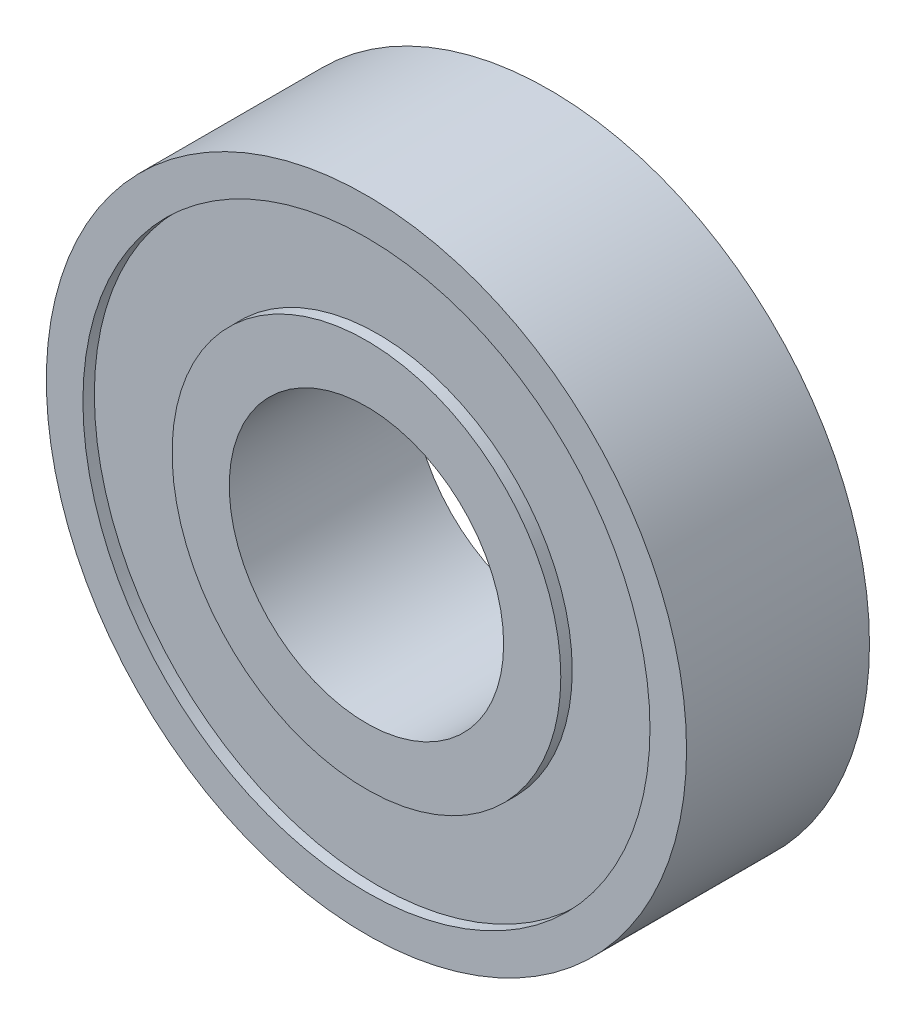
ISO-10303-21;
HEADER;
FILE_DESCRIPTION(('STEP AP214'),'2;1');
FILE_NAME('part.step','',(''),(''),'','','');
FILE_SCHEMA(('AUTOMOTIVE_DESIGN { 1 0 10303 214 1 1 1 1 }'));
ENDSEC;
DATA;
#1=APPLICATION_CONTEXT('core data for automotive mechanical design processes');
#2=APPLICATION_PROTOCOL_DEFINITION('international standard','automotive_design',2000,#1);
#3=PRODUCT_CONTEXT('',#1,'mechanical');
#4=PRODUCT('Part','Part','',(#3));
#5=PRODUCT_RELATED_PRODUCT_CATEGORY('part','',(#4));
#6=PRODUCT_DEFINITION_FORMATION('','',#4);
#7=PRODUCT_DEFINITION_CONTEXT('part definition',#1,'design');
#8=PRODUCT_DEFINITION('design','',#6,#7);
#9=PRODUCT_DEFINITION_SHAPE('','',#8);
#10=(LENGTH_UNIT() NAMED_UNIT(*) SI_UNIT(.MILLI.,.METRE.));
#11=(NAMED_UNIT(*) PLANE_ANGLE_UNIT() SI_UNIT($,.RADIAN.));
#12=(NAMED_UNIT(*) SI_UNIT($,.STERADIAN.) SOLID_ANGLE_UNIT());
#13=UNCERTAINTY_MEASURE_WITH_UNIT(LENGTH_MEASURE(1.E-05),#10,'distance_accuracy_value','');
#14=(GEOMETRIC_REPRESENTATION_CONTEXT(3) GLOBAL_UNCERTAINTY_ASSIGNED_CONTEXT((#13)) GLOBAL_UNIT_ASSIGNED_CONTEXT((#10,
#11,#12)) REPRESENTATION_CONTEXT('',''));
#15=CARTESIAN_POINT('',(0.,0.,0.));
#16=DIRECTION('',(0.,0.,1.));
#17=DIRECTION('',(1.,0.,0.));
#18=AXIS2_PLACEMENT_3D('',#15,#16,#17);
#19=CARTESIAN_POINT('',(0.,0.,-4.));
#20=DIRECTION('',(0.,0.,1.));
#21=DIRECTION('',(1.,0.,0.));
#22=AXIS2_PLACEMENT_3D('',#19,#20,#21);
#23=PLANE('',#22);
#24=CARTESIAN_POINT('',(0.,0.,-4.));
#25=DIRECTION('',(0.,0.,1.));
#26=DIRECTION('',(1.,0.,0.));
#27=AXIS2_PLACEMENT_3D('',#24,#25,#26);
#28=CIRCLE('',#27,6.);
#29=CARTESIAN_POINT('',(6.,0.,-4.));
#30=VERTEX_POINT('',#29);
#31=EDGE_CURVE('E55',#30,#30,#28,.T.);
#32=ORIENTED_EDGE('',*,*,#31,.T.);
#33=EDGE_LOOP('',(#32));
#34=FACE_BOUND('',#33,.T.);
#35=CARTESIAN_POINT('',(0.,0.,-4.));
#36=DIRECTION('',(0.,0.,1.));
#37=DIRECTION('',(1.,0.,0.));
#38=AXIS2_PLACEMENT_3D('',#35,#36,#37);
#39=CIRCLE('',#38,8.5);
#40=CARTESIAN_POINT('',(8.5,0.,-4.));
#41=VERTEX_POINT('',#40);
#42=EDGE_CURVE('E42',#41,#41,#39,.T.);
#43=ORIENTED_EDGE('',*,*,#42,.F.);
#44=EDGE_LOOP('',(#43));
#45=FACE_BOUND('',#44,.T.);
#46=ADVANCED_FACE('F31',(#34,#45),#23,.F.);
#47=CARTESIAN_POINT('',(0.,0.,-3.5));
#48=DIRECTION('',(0.,0.,-1.));
#49=DIRECTION('',(1.,0.,0.));
#50=AXIS2_PLACEMENT_3D('',#47,#48,#49);
#51=CYLINDRICAL_SURFACE('',#50,12.4);
#52=CARTESIAN_POINT('',(0.,0.,-3.5));
#53=DIRECTION('',(0.,0.,1.));
#54=DIRECTION('',(1.,0.,0.));
#55=AXIS2_PLACEMENT_3D('',#52,#53,#54);
#56=CIRCLE('',#55,12.4);
#57=CARTESIAN_POINT('',(12.4,0.,-3.5));
#58=VERTEX_POINT('',#57);
#59=EDGE_CURVE('E38',#58,#58,#56,.T.);
#60=ORIENTED_EDGE('',*,*,#59,.T.);
#61=EDGE_LOOP('',(#60));
#62=FACE_BOUND('',#61,.T.);
#63=CARTESIAN_POINT('',(0.,0.,-4.));
#64=DIRECTION('',(0.,0.,1.));
#65=DIRECTION('',(1.,0.,0.));
#66=AXIS2_PLACEMENT_3D('',#63,#64,#65);
#67=CIRCLE('',#66,12.4);
#68=CARTESIAN_POINT('',(12.4,0.,-4.));
#69=VERTEX_POINT('',#68);
#70=EDGE_CURVE('E10',#69,#69,#67,.T.);
#71=ORIENTED_EDGE('',*,*,#70,.F.);
#72=EDGE_LOOP('',(#71));
#73=FACE_BOUND('',#72,.T.);
#74=ADVANCED_FACE('F33',(#62,#73),#51,.F.);
#75=CARTESIAN_POINT('',(0.,0.,-3.5));
#76=DIRECTION('',(0.,0.,-1.));
#77=DIRECTION('',(1.,0.,0.));
#78=AXIS2_PLACEMENT_3D('',#75,#76,#77);
#79=PLANE('',#78);
#80=CARTESIAN_POINT('',(0.,0.,-3.5));
#81=DIRECTION('',(0.,0.,1.));
#82=DIRECTION('',(1.,0.,0.));
#83=AXIS2_PLACEMENT_3D('',#80,#81,#82);
#84=CIRCLE('',#83,8.5);
#85=CARTESIAN_POINT('',(8.5,0.,-3.5));
#86=VERTEX_POINT('',#85);
#87=EDGE_CURVE('E46',#86,#86,#84,.T.);
#88=ORIENTED_EDGE('',*,*,#87,.T.);
#89=EDGE_LOOP('',(#88));
#90=FACE_BOUND('',#89,.T.);
#91=ORIENTED_EDGE('',*,*,#59,.F.);
#92=EDGE_LOOP('',(#91));
#93=FACE_BOUND('',#92,.T.);
#94=ADVANCED_FACE('F118',(#90,#93),#79,.T.);
#95=CARTESIAN_POINT('',(0.,0.,-3.5));
#96=DIRECTION('',(0.,0.,-1.));
#97=DIRECTION('',(1.,0.,0.));
#98=AXIS2_PLACEMENT_3D('',#95,#96,#97);
#99=CYLINDRICAL_SURFACE('',#98,8.5);
#100=ORIENTED_EDGE('',*,*,#87,.F.);
#101=EDGE_LOOP('',(#100));
#102=FACE_BOUND('',#101,.T.);
#103=ORIENTED_EDGE('',*,*,#42,.T.);
#104=EDGE_LOOP('',(#103));
#105=FACE_BOUND('',#104,.T.);
#106=ADVANCED_FACE('F123',(#102,#105),#99,.T.);
#107=CARTESIAN_POINT('',(0.,0.,4.));
#108=DIRECTION('',(0.,0.,1.));
#109=DIRECTION('',(1.,0.,0.));
#110=AXIS2_PLACEMENT_3D('',#107,#108,#109);
#111=PLANE('',#110);
#112=CARTESIAN_POINT('',(0.,0.,4.));
#113=DIRECTION('',(0.,0.,1.));
#114=DIRECTION('',(1.,0.,0.));
#115=AXIS2_PLACEMENT_3D('',#112,#113,#114);
#116=CIRCLE('',#115,6.);
#117=CARTESIAN_POINT('',(6.,0.,4.));
#118=VERTEX_POINT('',#117);
#119=EDGE_CURVE('E58',#118,#118,#116,.T.);
#120=ORIENTED_EDGE('',*,*,#119,.F.);
#121=EDGE_LOOP('',(#120));
#122=FACE_BOUND('',#121,.T.);
#123=CARTESIAN_POINT('',(0.,0.,4.));
#124=DIRECTION('',(0.,0.,1.));
#125=DIRECTION('',(1.,0.,0.));
#126=AXIS2_PLACEMENT_3D('',#123,#124,#125);
#127=CIRCLE('',#126,8.5);
#128=CARTESIAN_POINT('',(8.5,0.,4.));
#129=VERTEX_POINT('',#128);
#130=EDGE_CURVE('E70',#129,#129,#127,.T.);
#131=ORIENTED_EDGE('',*,*,#130,.T.);
#132=EDGE_LOOP('',(#131));
#133=FACE_BOUND('',#132,.T.);
#134=ADVANCED_FACE('F98',(#122,#133),#111,.T.);
#135=CARTESIAN_POINT('',(0.,0.,4.));
#136=DIRECTION('',(0.,0.,-1.));
#137=DIRECTION('',(-1.,0.,0.));
#138=AXIS2_PLACEMENT_3D('',#135,#136,#137);
#139=CYLINDRICAL_SURFACE('',#138,14.);
#140=CARTESIAN_POINT('',(0.,0.,4.));
#141=DIRECTION('',(0.,0.,1.));
#142=DIRECTION('',(1.,0.,0.));
#143=AXIS2_PLACEMENT_3D('',#140,#141,#142);
#144=CIRCLE('',#143,14.);
#145=CARTESIAN_POINT('',(14.,0.,4.));
#146=VERTEX_POINT('',#145);
#147=EDGE_CURVE('E51',#146,#146,#144,.T.);
#148=ORIENTED_EDGE('',*,*,#147,.F.);
#149=EDGE_LOOP('',(#148));
#150=FACE_BOUND('',#149,.T.);
#151=CARTESIAN_POINT('',(0.,0.,-4.));
#152=DIRECTION('',(0.,0.,1.));
#153=DIRECTION('',(1.,0.,0.));
#154=AXIS2_PLACEMENT_3D('',#151,#152,#153);
#155=CIRCLE('',#154,14.);
#156=CARTESIAN_POINT('',(14.,0.,-4.));
#157=VERTEX_POINT('',#156);
#158=EDGE_CURVE('E52',#157,#157,#155,.T.);
#159=ORIENTED_EDGE('',*,*,#158,.T.);
#160=EDGE_LOOP('',(#159));
#161=FACE_BOUND('',#160,.T.);
#162=ADVANCED_FACE('F96',(#150,#161),#139,.T.);
#163=CARTESIAN_POINT('',(0.,0.,4.));
#164=DIRECTION('',(0.,0.,1.));
#165=DIRECTION('',(1.,0.,0.));
#166=AXIS2_PLACEMENT_3D('',#163,#164,#165);
#167=CIRCLE('',#166,12.4);
#168=CARTESIAN_POINT('',(12.4,0.,4.));
#169=VERTEX_POINT('',#168);
#170=EDGE_CURVE('E64',#169,#169,#167,.T.);
#171=ORIENTED_EDGE('',*,*,#170,.F.);
#172=EDGE_LOOP('',(#171));
#173=FACE_BOUND('',#172,.T.);
#174=ORIENTED_EDGE('',*,*,#147,.T.);
#175=EDGE_LOOP('',(#174));
#176=FACE_BOUND('',#175,.T.);
#177=ADVANCED_FACE('F92',(#173,#176),#111,.T.);
#178=ORIENTED_EDGE('',*,*,#70,.T.);
#179=EDGE_LOOP('',(#178));
#180=FACE_BOUND('',#179,.T.);
#181=ORIENTED_EDGE('',*,*,#158,.F.);
#182=EDGE_LOOP('',(#181));
#183=FACE_BOUND('',#182,.T.);
#184=ADVANCED_FACE('F95',(#180,#183),#23,.F.);
#185=CARTESIAN_POINT('',(0.,0.,-4.));
#186=DIRECTION('',(0.,0.,1.));
#187=DIRECTION('',(1.,0.,0.));
#188=AXIS2_PLACEMENT_3D('',#185,#186,#187);
#189=CYLINDRICAL_SURFACE('',#188,6.);
#190=ORIENTED_EDGE('',*,*,#31,.F.);
#191=EDGE_LOOP('',(#190));
#192=FACE_BOUND('',#191,.T.);
#193=ORIENTED_EDGE('',*,*,#119,.T.);
#194=EDGE_LOOP('',(#193));
#195=FACE_BOUND('',#194,.T.);
#196=ADVANCED_FACE('F88',(#192,#195),#189,.F.);
#197=CARTESIAN_POINT('',(0.,0.,3.5));
#198=DIRECTION('',(0.,0.,1.));
#199=DIRECTION('',(1.,0.,0.));
#200=AXIS2_PLACEMENT_3D('',#197,#198,#199);
#201=CYLINDRICAL_SURFACE('',#200,12.4);
#202=CARTESIAN_POINT('',(0.,0.,3.5));
#203=DIRECTION('',(0.,0.,1.));
#204=DIRECTION('',(1.,0.,0.));
#205=AXIS2_PLACEMENT_3D('',#202,#203,#204);
#206=CIRCLE('',#205,12.4);
#207=CARTESIAN_POINT('',(12.4,0.,3.5));
#208=VERTEX_POINT('',#207);
#209=EDGE_CURVE('E61',#208,#208,#206,.T.);
#210=ORIENTED_EDGE('',*,*,#209,.F.);
#211=EDGE_LOOP('',(#210));
#212=FACE_BOUND('',#211,.T.);
#213=ORIENTED_EDGE('',*,*,#170,.T.);
#214=EDGE_LOOP('',(#213));
#215=FACE_BOUND('',#214,.T.);
#216=ADVANCED_FACE('F82',(#212,#215),#201,.F.);
#217=CARTESIAN_POINT('',(0.,0.,3.5));
#218=DIRECTION('',(0.,0.,1.));
#219=DIRECTION('',(1.,0.,0.));
#220=AXIS2_PLACEMENT_3D('',#217,#218,#219);
#221=PLANE('',#220);
#222=CARTESIAN_POINT('',(0.,0.,3.5));
#223=DIRECTION('',(0.,0.,1.));
#224=DIRECTION('',(1.,0.,0.));
#225=AXIS2_PLACEMENT_3D('',#222,#223,#224);
#226=CIRCLE('',#225,8.5);
#227=CARTESIAN_POINT('',(8.5,0.,3.5));
#228=VERTEX_POINT('',#227);
#229=EDGE_CURVE('E67',#228,#228,#226,.T.);
#230=ORIENTED_EDGE('',*,*,#229,.F.);
#231=EDGE_LOOP('',(#230));
#232=FACE_BOUND('',#231,.T.);
#233=ORIENTED_EDGE('',*,*,#209,.T.);
#234=EDGE_LOOP('',(#233));
#235=FACE_BOUND('',#234,.T.);
#236=ADVANCED_FACE('F79',(#232,#235),#221,.T.);
#237=CARTESIAN_POINT('',(0.,0.,3.5));
#238=DIRECTION('',(0.,0.,1.));
#239=DIRECTION('',(1.,0.,0.));
#240=AXIS2_PLACEMENT_3D('',#237,#238,#239);
#241=CYLINDRICAL_SURFACE('',#240,8.5);
#242=ORIENTED_EDGE('',*,*,#229,.T.);
#243=EDGE_LOOP('',(#242));
#244=FACE_BOUND('',#243,.T.);
#245=ORIENTED_EDGE('',*,*,#130,.F.);
#246=EDGE_LOOP('',(#245));
#247=FACE_BOUND('',#246,.T.);
#248=ADVANCED_FACE('F76',(#244,#247),#241,.T.);
#249=CLOSED_SHELL('',(#46,#74,#94,#106,#134,#162,#177,#184,#196,#216,#236,#248));
#250=MANIFOLD_SOLID_BREP('B2',#249);
#251=ADVANCED_BREP_SHAPE_REPRESENTATION('',(#18,#250),#14);
#252=SHAPE_DEFINITION_REPRESENTATION(#9,#251);
ENDSEC;
END-ISO-10303-21;
